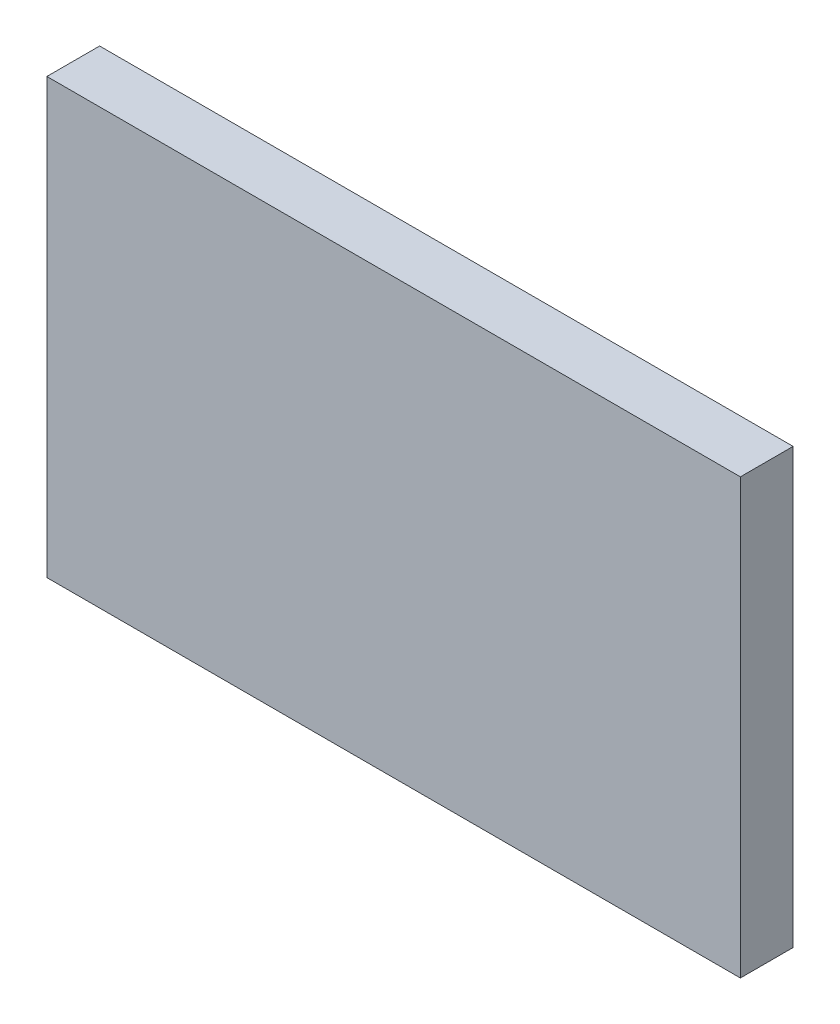
ISO-10303-21;
HEADER;
FILE_DESCRIPTION(('STEP AP214'),'2;1');
FILE_NAME('part.step','',(''),(''),'','','');
FILE_SCHEMA(('AUTOMOTIVE_DESIGN { 1 0 10303 214 1 1 1 1 }'));
ENDSEC;
DATA;
#1=APPLICATION_CONTEXT('core data for automotive mechanical design processes');
#2=APPLICATION_PROTOCOL_DEFINITION('international standard','automotive_design',2000,#1);
#3=PRODUCT_CONTEXT('',#1,'mechanical');
#4=PRODUCT('Part','Part','',(#3));
#5=PRODUCT_RELATED_PRODUCT_CATEGORY('part','',(#4));
#6=PRODUCT_DEFINITION_FORMATION('','',#4);
#7=PRODUCT_DEFINITION_CONTEXT('part definition',#1,'design');
#8=PRODUCT_DEFINITION('design','',#6,#7);
#9=PRODUCT_DEFINITION_SHAPE('','',#8);
#10=(LENGTH_UNIT() NAMED_UNIT(*) SI_UNIT(.MILLI.,.METRE.));
#11=(NAMED_UNIT(*) PLANE_ANGLE_UNIT() SI_UNIT($,.RADIAN.));
#12=(NAMED_UNIT(*) SI_UNIT($,.STERADIAN.) SOLID_ANGLE_UNIT());
#13=UNCERTAINTY_MEASURE_WITH_UNIT(LENGTH_MEASURE(1.E-05),#10,'distance_accuracy_value','');
#14=(GEOMETRIC_REPRESENTATION_CONTEXT(3) GLOBAL_UNCERTAINTY_ASSIGNED_CONTEXT((#13)) GLOBAL_UNIT_ASSIGNED_CONTEXT((#10,
#11,#12)) REPRESENTATION_CONTEXT('',''));
#15=CARTESIAN_POINT('',(0.,0.,0.));
#16=DIRECTION('',(0.,0.,1.));
#17=DIRECTION('',(1.,0.,0.));
#18=AXIS2_PLACEMENT_3D('',#15,#16,#17);
#19=CARTESIAN_POINT('',(-32.875,41.15,2.5));
#20=DIRECTION('',(1.,0.,0.));
#21=DIRECTION('',(0.,0.,-1.));
#22=AXIS2_PLACEMENT_3D('',#19,#20,#21);
#23=PLANE('',#22);
#24=DIRECTION('',(0.,0.,1.));
#25=VECTOR('',#24,1.);
#26=CARTESIAN_POINT('',(-32.875,0.,2.5));
#27=LINE('',#26,#25);
#28=CARTESIAN_POINT('',(-32.875,0.,-2.5));
#29=VERTEX_POINT('',#28);
#30=CARTESIAN_POINT('',(-32.875,0.,2.5));
#31=VERTEX_POINT('',#30);
#32=EDGE_CURVE('E97',#29,#31,#27,.T.);
#33=ORIENTED_EDGE('',*,*,#32,.T.);
#34=DIRECTION('',(0.,-1.,0.));
#35=VECTOR('',#34,1.);
#36=CARTESIAN_POINT('',(-32.875,41.15,2.5));
#37=LINE('',#36,#35);
#38=CARTESIAN_POINT('',(-32.875,41.15,2.5));
#39=VERTEX_POINT('',#38);
#40=EDGE_CURVE('E11',#39,#31,#37,.T.);
#41=ORIENTED_EDGE('',*,*,#40,.F.);
#42=DIRECTION('',(0.,0.,1.));
#43=VECTOR('',#42,1.);
#44=CARTESIAN_POINT('',(-32.875,41.15,2.5));
#45=LINE('',#44,#43);
#46=CARTESIAN_POINT('',(-32.875,41.15,-2.5));
#47=VERTEX_POINT('',#46);
#48=EDGE_CURVE('E85',#47,#39,#45,.T.);
#49=ORIENTED_EDGE('',*,*,#48,.F.);
#50=DIRECTION('',(0.,-1.,0.));
#51=VECTOR('',#50,1.);
#52=CARTESIAN_POINT('',(-32.875,41.15,-2.5));
#53=LINE('',#52,#51);
#54=EDGE_CURVE('E93',#47,#29,#53,.T.);
#55=ORIENTED_EDGE('',*,*,#54,.T.);
#56=EDGE_LOOP('',(#33,#41,#49,#55));
#57=FACE_BOUND('',#56,.T.);
#58=ADVANCED_FACE('F34',(#57),#23,.F.);
#59=CARTESIAN_POINT('',(32.875,41.15,2.5));
#60=DIRECTION('',(0.,0.,-1.));
#61=DIRECTION('',(-1.,0.,0.));
#62=AXIS2_PLACEMENT_3D('',#59,#60,#61);
#63=PLANE('',#62);
#64=DIRECTION('',(1.,0.,0.));
#65=VECTOR('',#64,1.);
#66=CARTESIAN_POINT('',(32.875,0.,2.5));
#67=LINE('',#66,#65);
#68=CARTESIAN_POINT('',(32.875,0.,2.5));
#69=VERTEX_POINT('',#68);
#70=EDGE_CURVE('E89',#31,#69,#67,.T.);
#71=ORIENTED_EDGE('',*,*,#70,.T.);
#72=DIRECTION('',(0.,-1.,0.));
#73=VECTOR('',#72,1.);
#74=CARTESIAN_POINT('',(32.875,41.15,2.5));
#75=LINE('',#74,#73);
#76=CARTESIAN_POINT('',(32.875,41.15,2.5));
#77=VERTEX_POINT('',#76);
#78=EDGE_CURVE('E42',#77,#69,#75,.T.);
#79=ORIENTED_EDGE('',*,*,#78,.F.);
#80=DIRECTION('',(1.,0.,0.));
#81=VECTOR('',#80,1.);
#82=CARTESIAN_POINT('',(32.875,41.15,2.5));
#83=LINE('',#82,#81);
#84=EDGE_CURVE('E80',#39,#77,#83,.T.);
#85=ORIENTED_EDGE('',*,*,#84,.F.);
#86=ORIENTED_EDGE('',*,*,#40,.T.);
#87=EDGE_LOOP('',(#71,#79,#85,#86));
#88=FACE_BOUND('',#87,.T.);
#89=ADVANCED_FACE('F88',(#88),#63,.F.);
#90=CARTESIAN_POINT('',(32.875,41.15,2.5));
#91=DIRECTION('',(-1.,0.,0.));
#92=DIRECTION('',(0.,0.,1.));
#93=AXIS2_PLACEMENT_3D('',#90,#91,#92);
#94=PLANE('',#93);
#95=DIRECTION('',(0.,0.,-1.));
#96=VECTOR('',#95,1.);
#97=CARTESIAN_POINT('',(32.875,0.,2.5));
#98=LINE('',#97,#96);
#99=CARTESIAN_POINT('',(32.875,0.,-2.5));
#100=VERTEX_POINT('',#99);
#101=EDGE_CURVE('E67',#69,#100,#98,.T.);
#102=ORIENTED_EDGE('',*,*,#101,.T.);
#103=DIRECTION('',(0.,-1.,0.));
#104=VECTOR('',#103,1.);
#105=CARTESIAN_POINT('',(32.875,41.15,-2.5));
#106=LINE('',#105,#104);
#107=CARTESIAN_POINT('',(32.875,41.15,-2.5));
#108=VERTEX_POINT('',#107);
#109=EDGE_CURVE('E90',#108,#100,#106,.T.);
#110=ORIENTED_EDGE('',*,*,#109,.F.);
#111=DIRECTION('',(0.,0.,-1.));
#112=VECTOR('',#111,1.);
#113=CARTESIAN_POINT('',(32.875,41.15,2.5));
#114=LINE('',#113,#112);
#115=EDGE_CURVE('E83',#77,#108,#114,.T.);
#116=ORIENTED_EDGE('',*,*,#115,.F.);
#117=ORIENTED_EDGE('',*,*,#78,.T.);
#118=EDGE_LOOP('',(#102,#110,#116,#117));
#119=FACE_BOUND('',#118,.T.);
#120=ADVANCED_FACE('F91',(#119),#94,.F.);
#121=CARTESIAN_POINT('',(32.875,41.15,-2.5));
#122=DIRECTION('',(0.,0.,1.));
#123=DIRECTION('',(1.,0.,0.));
#124=AXIS2_PLACEMENT_3D('',#121,#122,#123);
#125=PLANE('',#124);
#126=DIRECTION('',(-1.,0.,0.));
#127=VECTOR('',#126,1.);
#128=CARTESIAN_POINT('',(32.875,0.,-2.5));
#129=LINE('',#128,#127);
#130=EDGE_CURVE('E73',#100,#29,#129,.T.);
#131=ORIENTED_EDGE('',*,*,#130,.T.);
#132=ORIENTED_EDGE('',*,*,#54,.F.);
#133=DIRECTION('',(-1.,0.,0.));
#134=VECTOR('',#133,1.);
#135=CARTESIAN_POINT('',(32.875,41.15,-2.5));
#136=LINE('',#135,#134);
#137=EDGE_CURVE('E50',#108,#47,#136,.T.);
#138=ORIENTED_EDGE('',*,*,#137,.F.);
#139=ORIENTED_EDGE('',*,*,#109,.T.);
#140=EDGE_LOOP('',(#131,#132,#138,#139));
#141=FACE_BOUND('',#140,.T.);
#142=ADVANCED_FACE('F104',(#141),#125,.F.);
#143=CARTESIAN_POINT('',(0.,41.15,0.));
#144=DIRECTION('',(0.,1.,0.));
#145=DIRECTION('',(0.,0.,1.));
#146=AXIS2_PLACEMENT_3D('',#143,#144,#145);
#147=PLANE('',#146);
#148=ORIENTED_EDGE('',*,*,#48,.T.);
#149=ORIENTED_EDGE('',*,*,#84,.T.);
#150=ORIENTED_EDGE('',*,*,#115,.T.);
#151=ORIENTED_EDGE('',*,*,#137,.T.);
#152=EDGE_LOOP('',(#148,#149,#150,#151));
#153=FACE_BOUND('',#152,.T.);
#154=ADVANCED_FACE('F81',(#153),#147,.T.);
#155=CARTESIAN_POINT('',(0.,0.,0.));
#156=DIRECTION('',(0.,1.,0.));
#157=DIRECTION('',(0.,0.,1.));
#158=AXIS2_PLACEMENT_3D('',#155,#156,#157);
#159=PLANE('',#158);
#160=ORIENTED_EDGE('',*,*,#32,.F.);
#161=ORIENTED_EDGE('',*,*,#130,.F.);
#162=ORIENTED_EDGE('',*,*,#101,.F.);
#163=ORIENTED_EDGE('',*,*,#70,.F.);
#164=EDGE_LOOP('',(#160,#161,#162,#163));
#165=FACE_BOUND('',#164,.T.);
#166=ADVANCED_FACE('F107',(#165),#159,.F.);
#167=CLOSED_SHELL('',(#58,#89,#120,#142,#154,#166));
#168=MANIFOLD_SOLID_BREP('B2',#167);
#169=ADVANCED_BREP_SHAPE_REPRESENTATION('',(#18,#168),#14);
#170=SHAPE_DEFINITION_REPRESENTATION(#9,#169);
ENDSEC;
END-ISO-10303-21;
